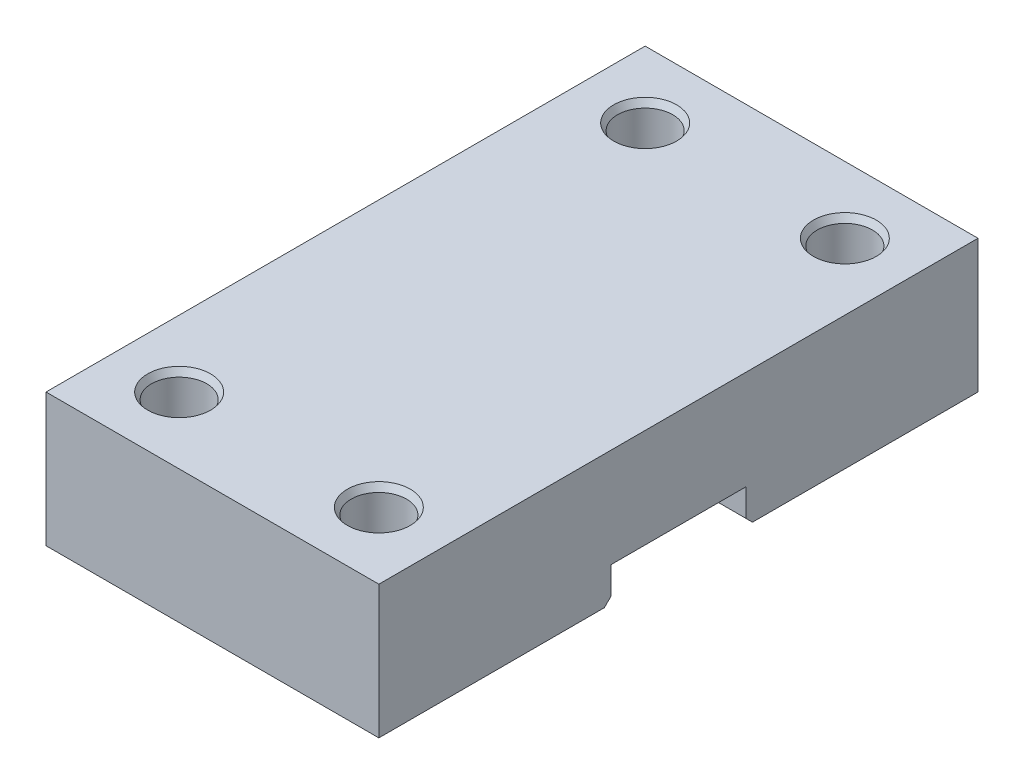
ISO-10303-21;
HEADER;
FILE_DESCRIPTION(('STEP AP214'),'2;1');
FILE_NAME('part.step','',(''),(''),'','','');
FILE_SCHEMA(('AUTOMOTIVE_DESIGN { 1 0 10303 214 1 1 1 1 }'));
ENDSEC;
DATA;
#1=APPLICATION_CONTEXT('core data for automotive mechanical design processes');
#2=APPLICATION_PROTOCOL_DEFINITION('international standard','automotive_design',2000,#1);
#3=PRODUCT_CONTEXT('',#1,'mechanical');
#4=PRODUCT('Part','Part','',(#3));
#5=PRODUCT_RELATED_PRODUCT_CATEGORY('part','',(#4));
#6=PRODUCT_DEFINITION_FORMATION('','',#4);
#7=PRODUCT_DEFINITION_CONTEXT('part definition',#1,'design');
#8=PRODUCT_DEFINITION('design','',#6,#7);
#9=PRODUCT_DEFINITION_SHAPE('','',#8);
#10=(LENGTH_UNIT() NAMED_UNIT(*) SI_UNIT(.MILLI.,.METRE.));
#11=(NAMED_UNIT(*) PLANE_ANGLE_UNIT() SI_UNIT($,.RADIAN.));
#12=(NAMED_UNIT(*) SI_UNIT($,.STERADIAN.) SOLID_ANGLE_UNIT());
#13=UNCERTAINTY_MEASURE_WITH_UNIT(LENGTH_MEASURE(1.E-05),#10,'distance_accuracy_value','');
#14=(GEOMETRIC_REPRESENTATION_CONTEXT(3) GLOBAL_UNCERTAINTY_ASSIGNED_CONTEXT((#13)) GLOBAL_UNIT_ASSIGNED_CONTEXT((#10,
#11,#12)) REPRESENTATION_CONTEXT('',''));
#15=CARTESIAN_POINT('',(0.,0.,0.));
#16=DIRECTION('',(0.,0.,1.));
#17=DIRECTION('',(1.,0.,0.));
#18=AXIS2_PLACEMENT_3D('',#15,#16,#17);
#19=CARTESIAN_POINT('',(0.,0.,0.));
#20=DIRECTION('',(0.,1.,0.));
#21=DIRECTION('',(0.,0.,1.));
#22=AXIS2_PLACEMENT_3D('',#19,#20,#21);
#23=PLANE('',#22);
#24=CARTESIAN_POINT('',(15.,0.,35.));
#25=DIRECTION('',(0.,-1.,0.));
#26=DIRECTION('',(0.,0.,-1.));
#27=AXIS2_PLACEMENT_3D('',#24,#25,#26);
#28=CIRCLE('',#27,4.15);
#29=CARTESIAN_POINT('',(15.,0.,30.85));
#30=VERTEX_POINT('',#29);
#31=EDGE_CURVE('E242',#30,#30,#28,.T.);
#32=ORIENTED_EDGE('',*,*,#31,.F.);
#33=EDGE_LOOP('',(#32));
#34=FACE_BOUND('',#33,.T.);
#35=CARTESIAN_POINT('',(-15.,0.,35.));
#36=DIRECTION('',(0.,-1.,0.));
#37=DIRECTION('',(0.,0.,-1.));
#38=AXIS2_PLACEMENT_3D('',#35,#36,#37);
#39=CIRCLE('',#38,4.15);
#40=CARTESIAN_POINT('',(-15.,0.,30.85));
#41=VERTEX_POINT('',#40);
#42=EDGE_CURVE('E240',#41,#41,#39,.T.);
#43=ORIENTED_EDGE('',*,*,#42,.F.);
#44=EDGE_LOOP('',(#43));
#45=FACE_BOUND('',#44,.T.);
#46=DIRECTION('',(0.,0.,1.));
#47=VECTOR('',#46,1.);
#48=CARTESIAN_POINT('',(-25.,0.,45.));
#49=LINE('',#48,#47);
#50=CARTESIAN_POINT('',(-25.,0.,11.125));
#51=VERTEX_POINT('',#50);
#52=CARTESIAN_POINT('',(-25.,0.,45.));
#53=VERTEX_POINT('',#52);
#54=EDGE_CURVE('E143',#51,#53,#49,.T.);
#55=ORIENTED_EDGE('',*,*,#54,.F.);
#56=DIRECTION('',(1.,0.,0.));
#57=VECTOR('',#56,1.);
#58=CARTESIAN_POINT('',(0.,0.,11.125));
#59=LINE('',#58,#57);
#60=CARTESIAN_POINT('',(25.,0.,11.125));
#61=VERTEX_POINT('',#60);
#62=EDGE_CURVE('E43',#51,#61,#59,.T.);
#63=ORIENTED_EDGE('',*,*,#62,.T.);
#64=DIRECTION('',(0.,0.,-1.));
#65=VECTOR('',#64,1.);
#66=CARTESIAN_POINT('',(25.,0.,45.));
#67=LINE('',#66,#65);
#68=CARTESIAN_POINT('',(25.,0.,45.));
#69=VERTEX_POINT('',#68);
#70=EDGE_CURVE('E160',#69,#61,#67,.T.);
#71=ORIENTED_EDGE('',*,*,#70,.F.);
#72=DIRECTION('',(1.,0.,0.));
#73=VECTOR('',#72,1.);
#74=CARTESIAN_POINT('',(25.,0.,45.));
#75=LINE('',#74,#73);
#76=EDGE_CURVE('E157',#53,#69,#75,.T.);
#77=ORIENTED_EDGE('',*,*,#76,.F.);
#78=EDGE_LOOP('',(#55,#63,#71,#77));
#79=FACE_BOUND('',#78,.T.);
#80=ADVANCED_FACE('F35',(#34,#45,#79),#23,.F.);
#81=CARTESIAN_POINT('',(-25.,20.,45.));
#82=DIRECTION('',(1.,0.,0.));
#83=DIRECTION('',(0.,0.,-1.));
#84=AXIS2_PLACEMENT_3D('',#81,#82,#83);
#85=PLANE('',#84);
#86=CARTESIAN_POINT('',(-25.,0.,-45.));
#87=VERTEX_POINT('',#86);
#88=CARTESIAN_POINT('',(-25.,0.,-11.125));
#89=VERTEX_POINT('',#88);
#90=EDGE_CURVE('E155',#87,#89,#49,.T.);
#91=ORIENTED_EDGE('',*,*,#90,.T.);
#92=DIRECTION('',(0.,-0.707106781186552,-0.707106781186543));
#93=VECTOR('',#92,1.);
#94=CARTESIAN_POINT('',(-25.,1.00000000000003,-10.125));
#95=LINE('',#94,#93);
#96=CARTESIAN_POINT('',(-25.,1.00000000000003,-10.125));
#97=VERTEX_POINT('',#96);
#98=EDGE_CURVE('E118',#89,#97,#95,.F.);
#99=ORIENTED_EDGE('',*,*,#98,.T.);
#100=DIRECTION('',(0.,1.,0.));
#101=VECTOR('',#100,1.);
#102=CARTESIAN_POINT('',(-25.,5.10000000000001,-10.125));
#103=LINE('',#102,#101);
#104=CARTESIAN_POINT('',(-25.,5.10000000000001,-10.125));
#105=VERTEX_POINT('',#104);
#106=EDGE_CURVE('E111',#97,#105,#103,.T.);
#107=ORIENTED_EDGE('',*,*,#106,.T.);
#108=DIRECTION('',(0.,0.,1.));
#109=VECTOR('',#108,1.);
#110=CARTESIAN_POINT('',(-25.,5.10000000000001,-10.125));
#111=LINE('',#110,#109);
#112=CARTESIAN_POINT('',(-25.,5.1,10.125));
#113=VERTEX_POINT('',#112);
#114=EDGE_CURVE('E116',#105,#113,#111,.T.);
#115=ORIENTED_EDGE('',*,*,#114,.T.);
#116=DIRECTION('',(0.,-1.,0.));
#117=VECTOR('',#116,1.);
#118=CARTESIAN_POINT('',(-25.,5.1,10.125));
#119=LINE('',#118,#117);
#120=CARTESIAN_POINT('',(-25.,1.00000000000001,10.125));
#121=VERTEX_POINT('',#120);
#122=EDGE_CURVE('E122',#113,#121,#119,.T.);
#123=ORIENTED_EDGE('',*,*,#122,.T.);
#124=DIRECTION('',(0.,0.707106781186548,-0.707106781186548));
#125=VECTOR('',#124,1.);
#126=CARTESIAN_POINT('',(-25.,0.,11.125));
#127=LINE('',#126,#125);
#128=EDGE_CURVE('E50',#121,#51,#127,.F.);
#129=ORIENTED_EDGE('',*,*,#128,.T.);
#130=ORIENTED_EDGE('',*,*,#54,.T.);
#131=DIRECTION('',(0.,-1.,0.));
#132=VECTOR('',#131,1.);
#133=CARTESIAN_POINT('',(-25.,20.,45.));
#134=LINE('',#133,#132);
#135=CARTESIAN_POINT('',(-25.,20.,45.));
#136=VERTEX_POINT('',#135);
#137=EDGE_CURVE('E172',#136,#53,#134,.T.);
#138=ORIENTED_EDGE('',*,*,#137,.F.);
#139=DIRECTION('',(0.,0.,1.));
#140=VECTOR('',#139,1.);
#141=CARTESIAN_POINT('',(-25.,20.,45.));
#142=LINE('',#141,#140);
#143=CARTESIAN_POINT('',(-25.,20.,-45.));
#144=VERTEX_POINT('',#143);
#145=EDGE_CURVE('E144',#144,#136,#142,.T.);
#146=ORIENTED_EDGE('',*,*,#145,.F.);
#147=DIRECTION('',(0.,-1.,0.));
#148=VECTOR('',#147,1.);
#149=CARTESIAN_POINT('',(-25.,20.,-45.));
#150=LINE('',#149,#148);
#151=EDGE_CURVE('E154',#144,#87,#150,.T.);
#152=ORIENTED_EDGE('',*,*,#151,.T.);
#153=EDGE_LOOP('',(#91,#99,#107,#115,#123,#129,#130,#138,#146,#152));
#154=FACE_BOUND('',#153,.T.);
#155=ADVANCED_FACE('F114',(#154),#85,.F.);
#156=CARTESIAN_POINT('',(25.,20.,45.));
#157=DIRECTION('',(0.,0.,-1.));
#158=DIRECTION('',(-1.,0.,0.));
#159=AXIS2_PLACEMENT_3D('',#156,#157,#158);
#160=PLANE('',#159);
#161=ORIENTED_EDGE('',*,*,#76,.T.);
#162=DIRECTION('',(0.,-1.,0.));
#163=VECTOR('',#162,1.);
#164=CARTESIAN_POINT('',(25.,20.,45.));
#165=LINE('',#164,#163);
#166=CARTESIAN_POINT('',(25.,20.,45.));
#167=VERTEX_POINT('',#166);
#168=EDGE_CURVE('E169',#167,#69,#165,.T.);
#169=ORIENTED_EDGE('',*,*,#168,.F.);
#170=DIRECTION('',(1.,0.,0.));
#171=VECTOR('',#170,1.);
#172=CARTESIAN_POINT('',(25.,20.,45.));
#173=LINE('',#172,#171);
#174=EDGE_CURVE('E147',#136,#167,#173,.T.);
#175=ORIENTED_EDGE('',*,*,#174,.F.);
#176=ORIENTED_EDGE('',*,*,#137,.T.);
#177=EDGE_LOOP('',(#161,#169,#175,#176));
#178=FACE_BOUND('',#177,.T.);
#179=ADVANCED_FACE('F222',(#178),#160,.F.);
#180=CARTESIAN_POINT('',(25.,20.,45.));
#181=DIRECTION('',(-1.,0.,0.));
#182=DIRECTION('',(0.,0.,1.));
#183=AXIS2_PLACEMENT_3D('',#180,#181,#182);
#184=PLANE('',#183);
#185=DIRECTION('',(0.,-1.,0.));
#186=VECTOR('',#185,1.);
#187=CARTESIAN_POINT('',(25.,20.,-10.125));
#188=LINE('',#187,#186);
#189=CARTESIAN_POINT('',(25.,5.10000000000001,-10.125));
#190=VERTEX_POINT('',#189);
#191=CARTESIAN_POINT('',(25.,1.00000000000003,-10.125));
#192=VERTEX_POINT('',#191);
#193=EDGE_CURVE('E128',#190,#192,#188,.T.);
#194=ORIENTED_EDGE('',*,*,#193,.T.);
#195=DIRECTION('',(0.,0.707106781186552,0.707106781186543));
#196=VECTOR('',#195,1.);
#197=CARTESIAN_POINT('',(25.,1.00000000000003,-10.125));
#198=LINE('',#197,#196);
#199=CARTESIAN_POINT('',(25.,0.,-11.125));
#200=VERTEX_POINT('',#199);
#201=EDGE_CURVE('E205',#192,#200,#198,.F.);
#202=ORIENTED_EDGE('',*,*,#201,.T.);
#203=CARTESIAN_POINT('',(25.,0.,-45.));
#204=VERTEX_POINT('',#203);
#205=EDGE_CURVE('E159',#200,#204,#67,.T.);
#206=ORIENTED_EDGE('',*,*,#205,.T.);
#207=DIRECTION('',(0.,-1.,0.));
#208=VECTOR('',#207,1.);
#209=CARTESIAN_POINT('',(25.,20.,-45.));
#210=LINE('',#209,#208);
#211=CARTESIAN_POINT('',(25.,20.,-45.));
#212=VERTEX_POINT('',#211);
#213=EDGE_CURVE('E166',#212,#204,#210,.T.);
#214=ORIENTED_EDGE('',*,*,#213,.F.);
#215=DIRECTION('',(0.,0.,-1.));
#216=VECTOR('',#215,1.);
#217=CARTESIAN_POINT('',(25.,20.,45.));
#218=LINE('',#217,#216);
#219=EDGE_CURVE('E150',#167,#212,#218,.T.);
#220=ORIENTED_EDGE('',*,*,#219,.F.);
#221=ORIENTED_EDGE('',*,*,#168,.T.);
#222=ORIENTED_EDGE('',*,*,#70,.T.);
#223=DIRECTION('',(0.,-0.707106781186548,0.707106781186548));
#224=VECTOR('',#223,1.);
#225=CARTESIAN_POINT('',(25.,0.,11.125));
#226=LINE('',#225,#224);
#227=CARTESIAN_POINT('',(25.,1.00000000000001,10.125));
#228=VERTEX_POINT('',#227);
#229=EDGE_CURVE('E203',#61,#228,#226,.F.);
#230=ORIENTED_EDGE('',*,*,#229,.T.);
#231=DIRECTION('',(0.,1.,0.));
#232=VECTOR('',#231,1.);
#233=CARTESIAN_POINT('',(25.,20.,10.125));
#234=LINE('',#233,#232);
#235=CARTESIAN_POINT('',(25.,5.1,10.125));
#236=VERTEX_POINT('',#235);
#237=EDGE_CURVE('E141',#228,#236,#234,.T.);
#238=ORIENTED_EDGE('',*,*,#237,.T.);
#239=DIRECTION('',(0.,0.,-1.));
#240=VECTOR('',#239,1.);
#241=CARTESIAN_POINT('',(25.,5.1,45.));
#242=LINE('',#241,#240);
#243=EDGE_CURVE('E175',#236,#190,#242,.T.);
#244=ORIENTED_EDGE('',*,*,#243,.T.);
#245=EDGE_LOOP('',(#194,#202,#206,#214,#220,#221,#222,#230,#238,#244));
#246=FACE_BOUND('',#245,.T.);
#247=ADVANCED_FACE('F217',(#246),#184,.F.);
#248=CARTESIAN_POINT('',(25.,20.,-45.));
#249=DIRECTION('',(0.,0.,1.));
#250=DIRECTION('',(1.,0.,0.));
#251=AXIS2_PLACEMENT_3D('',#248,#249,#250);
#252=PLANE('',#251);
#253=DIRECTION('',(-1.,0.,0.));
#254=VECTOR('',#253,1.);
#255=CARTESIAN_POINT('',(25.,0.,-45.));
#256=LINE('',#255,#254);
#257=EDGE_CURVE('E148',#204,#87,#256,.T.);
#258=ORIENTED_EDGE('',*,*,#257,.T.);
#259=ORIENTED_EDGE('',*,*,#151,.F.);
#260=DIRECTION('',(-1.,0.,0.));
#261=VECTOR('',#260,1.);
#262=CARTESIAN_POINT('',(25.,20.,-45.));
#263=LINE('',#262,#261);
#264=EDGE_CURVE('E152',#212,#144,#263,.T.);
#265=ORIENTED_EDGE('',*,*,#264,.F.);
#266=ORIENTED_EDGE('',*,*,#213,.T.);
#267=EDGE_LOOP('',(#258,#259,#265,#266));
#268=FACE_BOUND('',#267,.T.);
#269=ADVANCED_FACE('F231',(#268),#252,.F.);
#270=CARTESIAN_POINT('',(0.,20.,0.));
#271=DIRECTION('',(0.,1.,0.));
#272=DIRECTION('',(0.,0.,1.));
#273=AXIS2_PLACEMENT_3D('',#270,#271,#272);
#274=PLANE('',#273);
#275=CARTESIAN_POINT('',(15.,20.,-35.));
#276=DIRECTION('',(0.,1.,0.));
#277=DIRECTION('',(0.,0.,1.));
#278=AXIS2_PLACEMENT_3D('',#275,#276,#277);
#279=CIRCLE('',#278,4.72735026918963);
#280=CARTESIAN_POINT('',(15.,20.,-30.2726497308104));
#281=VERTEX_POINT('',#280);
#282=EDGE_CURVE('E186',#281,#281,#279,.F.);
#283=ORIENTED_EDGE('',*,*,#282,.T.);
#284=EDGE_LOOP('',(#283));
#285=FACE_BOUND('',#284,.T.);
#286=CARTESIAN_POINT('',(15.,20.,35.));
#287=DIRECTION('',(0.,1.,0.));
#288=DIRECTION('',(0.,0.,1.));
#289=AXIS2_PLACEMENT_3D('',#286,#287,#288);
#290=CIRCLE('',#289,4.72735026918963);
#291=CARTESIAN_POINT('',(15.,20.,39.7273502691896));
#292=VERTEX_POINT('',#291);
#293=EDGE_CURVE('E183',#292,#292,#290,.F.);
#294=ORIENTED_EDGE('',*,*,#293,.T.);
#295=EDGE_LOOP('',(#294));
#296=FACE_BOUND('',#295,.T.);
#297=CARTESIAN_POINT('',(-15.,20.,35.));
#298=DIRECTION('',(0.,1.,0.));
#299=DIRECTION('',(0.,0.,1.));
#300=AXIS2_PLACEMENT_3D('',#297,#298,#299);
#301=CIRCLE('',#300,4.72735026918963);
#302=CARTESIAN_POINT('',(-15.,20.,39.7273502691896));
#303=VERTEX_POINT('',#302);
#304=EDGE_CURVE('E180',#303,#303,#301,.F.);
#305=ORIENTED_EDGE('',*,*,#304,.T.);
#306=EDGE_LOOP('',(#305));
#307=FACE_BOUND('',#306,.T.);
#308=CARTESIAN_POINT('',(-15.,20.,-35.));
#309=DIRECTION('',(0.,1.,0.));
#310=DIRECTION('',(0.,0.,1.));
#311=AXIS2_PLACEMENT_3D('',#308,#309,#310);
#312=CIRCLE('',#311,4.72735026918963);
#313=CARTESIAN_POINT('',(-15.,20.,-30.2726497308104));
#314=VERTEX_POINT('',#313);
#315=EDGE_CURVE('E177',#314,#314,#312,.F.);
#316=ORIENTED_EDGE('',*,*,#315,.T.);
#317=EDGE_LOOP('',(#316));
#318=FACE_BOUND('',#317,.T.);
#319=ORIENTED_EDGE('',*,*,#145,.T.);
#320=ORIENTED_EDGE('',*,*,#174,.T.);
#321=ORIENTED_EDGE('',*,*,#219,.T.);
#322=ORIENTED_EDGE('',*,*,#264,.T.);
#323=EDGE_LOOP('',(#319,#320,#321,#322));
#324=FACE_BOUND('',#323,.T.);
#325=ADVANCED_FACE('F228',(#285,#296,#307,#318,#324),#274,.T.);
#326=CARTESIAN_POINT('',(15.,0.,-35.));
#327=DIRECTION('',(0.,-1.,0.));
#328=DIRECTION('',(0.,0.,-1.));
#329=AXIS2_PLACEMENT_3D('',#326,#327,#328);
#330=CIRCLE('',#329,4.15);
#331=CARTESIAN_POINT('',(15.,0.,-39.15));
#332=VERTEX_POINT('',#331);
#333=EDGE_CURVE('E248',#332,#332,#330,.T.);
#334=ORIENTED_EDGE('',*,*,#333,.F.);
#335=EDGE_LOOP('',(#334));
#336=FACE_BOUND('',#335,.T.);
#337=CARTESIAN_POINT('',(-15.,0.,-35.));
#338=DIRECTION('',(0.,-1.,0.));
#339=DIRECTION('',(0.,0.,-1.));
#340=AXIS2_PLACEMENT_3D('',#337,#338,#339);
#341=CIRCLE('',#340,4.15);
#342=CARTESIAN_POINT('',(-15.,0.,-39.15));
#343=VERTEX_POINT('',#342);
#344=EDGE_CURVE('E245',#343,#343,#341,.T.);
#345=ORIENTED_EDGE('',*,*,#344,.F.);
#346=EDGE_LOOP('',(#345));
#347=FACE_BOUND('',#346,.T.);
#348=ORIENTED_EDGE('',*,*,#205,.F.);
#349=DIRECTION('',(-1.,0.,0.));
#350=VECTOR('',#349,1.);
#351=CARTESIAN_POINT('',(0.,0.,-11.125));
#352=LINE('',#351,#350);
#353=EDGE_CURVE('E207',#200,#89,#352,.T.);
#354=ORIENTED_EDGE('',*,*,#353,.T.);
#355=ORIENTED_EDGE('',*,*,#90,.F.);
#356=ORIENTED_EDGE('',*,*,#257,.F.);
#357=EDGE_LOOP('',(#348,#354,#355,#356));
#358=FACE_BOUND('',#357,.T.);
#359=ADVANCED_FACE('F235',(#336,#347,#358),#23,.F.);
#360=CARTESIAN_POINT('',(-25.,5.10000000000001,-10.125));
#361=DIRECTION('',(0.,1.,0.));
#362=DIRECTION('',(0.,0.,1.));
#363=AXIS2_PLACEMENT_3D('',#360,#361,#362);
#364=PLANE('',#363);
#365=DIRECTION('',(1.,0.,0.));
#366=VECTOR('',#365,1.);
#367=CARTESIAN_POINT('',(-25.,5.1,10.125));
#368=LINE('',#367,#366);
#369=EDGE_CURVE('E132',#113,#236,#368,.T.);
#370=ORIENTED_EDGE('',*,*,#369,.F.);
#371=ORIENTED_EDGE('',*,*,#114,.F.);
#372=DIRECTION('',(1.,0.,0.));
#373=VECTOR('',#372,1.);
#374=CARTESIAN_POINT('',(-25.,5.10000000000001,-10.125));
#375=LINE('',#374,#373);
#376=EDGE_CURVE('E125',#105,#190,#375,.T.);
#377=ORIENTED_EDGE('',*,*,#376,.T.);
#378=ORIENTED_EDGE('',*,*,#243,.F.);
#379=EDGE_LOOP('',(#370,#371,#377,#378));
#380=FACE_BOUND('',#379,.T.);
#381=ADVANCED_FACE('F134',(#380),#364,.F.);
#382=CARTESIAN_POINT('',(-25.,5.1,10.125));
#383=DIRECTION('',(0.,0.,1.));
#384=DIRECTION('',(1.,0.,0.));
#385=AXIS2_PLACEMENT_3D('',#382,#383,#384);
#386=PLANE('',#385);
#387=ORIENTED_EDGE('',*,*,#237,.F.);
#388=DIRECTION('',(-1.,0.,0.));
#389=VECTOR('',#388,1.);
#390=CARTESIAN_POINT('',(-25.,1.00000000000001,10.125));
#391=LINE('',#390,#389);
#392=EDGE_CURVE('E11',#228,#121,#391,.T.);
#393=ORIENTED_EDGE('',*,*,#392,.T.);
#394=ORIENTED_EDGE('',*,*,#122,.F.);
#395=ORIENTED_EDGE('',*,*,#369,.T.);
#396=EDGE_LOOP('',(#387,#393,#394,#395));
#397=FACE_BOUND('',#396,.T.);
#398=ADVANCED_FACE('F239',(#397),#386,.F.);
#399=CARTESIAN_POINT('',(-25.,5.10000000000001,-10.125));
#400=DIRECTION('',(0.,0.,-1.));
#401=DIRECTION('',(0.,1.,0.));
#402=AXIS2_PLACEMENT_3D('',#399,#400,#401);
#403=PLANE('',#402);
#404=ORIENTED_EDGE('',*,*,#106,.F.);
#405=DIRECTION('',(1.,0.,0.));
#406=VECTOR('',#405,1.);
#407=CARTESIAN_POINT('',(-25.,1.00000000000003,-10.125));
#408=LINE('',#407,#406);
#409=EDGE_CURVE('E201',#97,#192,#408,.T.);
#410=ORIENTED_EDGE('',*,*,#409,.T.);
#411=ORIENTED_EDGE('',*,*,#193,.F.);
#412=ORIENTED_EDGE('',*,*,#376,.F.);
#413=EDGE_LOOP('',(#404,#410,#411,#412));
#414=FACE_BOUND('',#413,.T.);
#415=ADVANCED_FACE('F126',(#414),#403,.F.);
#416=CARTESIAN_POINT('',(-15.,20.,35.));
#417=DIRECTION('',(0.,-1.,0.));
#418=DIRECTION('',(0.,0.,-1.));
#419=AXIS2_PLACEMENT_3D('',#416,#417,#418);
#420=CYLINDRICAL_SURFACE('',#419,4.15);
#421=CARTESIAN_POINT('',(-15.,19.,35.));
#422=DIRECTION('',(0.,1.,0.));
#423=DIRECTION('',(0.,0.,1.));
#424=AXIS2_PLACEMENT_3D('',#421,#422,#423);
#425=CIRCLE('',#424,4.15);
#426=CARTESIAN_POINT('',(-15.,19.,39.15));
#427=VERTEX_POINT('',#426);
#428=EDGE_CURVE('E195',#427,#427,#425,.T.);
#429=ORIENTED_EDGE('',*,*,#428,.T.);
#430=EDGE_LOOP('',(#429));
#431=FACE_BOUND('',#430,.T.);
#432=ORIENTED_EDGE('',*,*,#42,.T.);
#433=EDGE_LOOP('',(#432));
#434=FACE_BOUND('',#433,.T.);
#435=ADVANCED_FACE('F261',(#431,#434),#420,.F.);
#436=CARTESIAN_POINT('',(-15.,20.,-35.));
#437=DIRECTION('',(0.,-1.,0.));
#438=DIRECTION('',(0.,0.,-1.));
#439=AXIS2_PLACEMENT_3D('',#436,#437,#438);
#440=CYLINDRICAL_SURFACE('',#439,4.15);
#441=CARTESIAN_POINT('',(-15.,19.,-35.));
#442=DIRECTION('',(0.,1.,0.));
#443=DIRECTION('',(0.,0.,1.));
#444=AXIS2_PLACEMENT_3D('',#441,#442,#443);
#445=CIRCLE('',#444,4.15);
#446=CARTESIAN_POINT('',(-15.,19.,-30.85));
#447=VERTEX_POINT('',#446);
#448=EDGE_CURVE('E198',#447,#447,#445,.T.);
#449=ORIENTED_EDGE('',*,*,#448,.T.);
#450=EDGE_LOOP('',(#449));
#451=FACE_BOUND('',#450,.T.);
#452=ORIENTED_EDGE('',*,*,#344,.T.);
#453=EDGE_LOOP('',(#452));
#454=FACE_BOUND('',#453,.T.);
#455=ADVANCED_FACE('F263',(#451,#454),#440,.F.);
#456=CARTESIAN_POINT('',(15.,20.,-35.));
#457=DIRECTION('',(0.,-1.,0.));
#458=DIRECTION('',(0.,0.,-1.));
#459=AXIS2_PLACEMENT_3D('',#456,#457,#458);
#460=CYLINDRICAL_SURFACE('',#459,4.15);
#461=CARTESIAN_POINT('',(15.,19.,-35.));
#462=DIRECTION('',(0.,1.,0.));
#463=DIRECTION('',(0.,0.,1.));
#464=AXIS2_PLACEMENT_3D('',#461,#462,#463);
#465=CIRCLE('',#464,4.15);
#466=CARTESIAN_POINT('',(15.,19.,-30.85));
#467=VERTEX_POINT('',#466);
#468=EDGE_CURVE('E189',#467,#467,#465,.T.);
#469=ORIENTED_EDGE('',*,*,#468,.T.);
#470=EDGE_LOOP('',(#469));
#471=FACE_BOUND('',#470,.T.);
#472=ORIENTED_EDGE('',*,*,#333,.T.);
#473=EDGE_LOOP('',(#472));
#474=FACE_BOUND('',#473,.T.);
#475=ADVANCED_FACE('F270',(#471,#474),#460,.F.);
#476=CARTESIAN_POINT('',(15.,20.,35.));
#477=DIRECTION('',(0.,-1.,0.));
#478=DIRECTION('',(0.,0.,-1.));
#479=AXIS2_PLACEMENT_3D('',#476,#477,#478);
#480=CYLINDRICAL_SURFACE('',#479,4.15);
#481=CARTESIAN_POINT('',(15.,19.,35.));
#482=DIRECTION('',(0.,1.,0.));
#483=DIRECTION('',(0.,0.,1.));
#484=AXIS2_PLACEMENT_3D('',#481,#482,#483);
#485=CIRCLE('',#484,4.15);
#486=CARTESIAN_POINT('',(15.,19.,39.15));
#487=VERTEX_POINT('',#486);
#488=EDGE_CURVE('E192',#487,#487,#485,.T.);
#489=ORIENTED_EDGE('',*,*,#488,.T.);
#490=EDGE_LOOP('',(#489));
#491=FACE_BOUND('',#490,.T.);
#492=ORIENTED_EDGE('',*,*,#31,.T.);
#493=EDGE_LOOP('',(#492));
#494=FACE_BOUND('',#493,.T.);
#495=ADVANCED_FACE('F254',(#491,#494),#480,.F.);
#496=CARTESIAN_POINT('',(15.,20.,-35.));
#497=DIRECTION('',(0.,1.,0.));
#498=DIRECTION('',(0.,0.,1.));
#499=AXIS2_PLACEMENT_3D('',#496,#497,#498);
#500=CONICAL_SURFACE('',#499,4.72735026918963,0.523598775598292);
#501=ORIENTED_EDGE('',*,*,#468,.F.);
#502=EDGE_LOOP('',(#501));
#503=FACE_BOUND('',#502,.T.);
#504=ORIENTED_EDGE('',*,*,#282,.F.);
#505=EDGE_LOOP('',(#504));
#506=FACE_BOUND('',#505,.T.);
#507=ADVANCED_FACE('F294',(#503,#506),#500,.F.);
#508=CARTESIAN_POINT('',(15.,20.,35.));
#509=DIRECTION('',(0.,1.,0.));
#510=DIRECTION('',(0.,0.,1.));
#511=AXIS2_PLACEMENT_3D('',#508,#509,#510);
#512=CONICAL_SURFACE('',#511,4.72735026918963,0.523598775598292);
#513=ORIENTED_EDGE('',*,*,#488,.F.);
#514=EDGE_LOOP('',(#513));
#515=FACE_BOUND('',#514,.T.);
#516=ORIENTED_EDGE('',*,*,#293,.F.);
#517=EDGE_LOOP('',(#516));
#518=FACE_BOUND('',#517,.T.);
#519=ADVANCED_FACE('F297',(#515,#518),#512,.F.);
#520=CARTESIAN_POINT('',(-15.,20.,35.));
#521=DIRECTION('',(0.,1.,0.));
#522=DIRECTION('',(0.,0.,1.));
#523=AXIS2_PLACEMENT_3D('',#520,#521,#522);
#524=CONICAL_SURFACE('',#523,4.72735026918963,0.523598775598292);
#525=ORIENTED_EDGE('',*,*,#428,.F.);
#526=EDGE_LOOP('',(#525));
#527=FACE_BOUND('',#526,.T.);
#528=ORIENTED_EDGE('',*,*,#304,.F.);
#529=EDGE_LOOP('',(#528));
#530=FACE_BOUND('',#529,.T.);
#531=ADVANCED_FACE('F301',(#527,#530),#524,.F.);
#532=CARTESIAN_POINT('',(-15.,20.,-35.));
#533=DIRECTION('',(0.,1.,0.));
#534=DIRECTION('',(0.,0.,1.));
#535=AXIS2_PLACEMENT_3D('',#532,#533,#534);
#536=CONICAL_SURFACE('',#535,4.72735026918963,0.523598775598292);
#537=ORIENTED_EDGE('',*,*,#448,.F.);
#538=EDGE_LOOP('',(#537));
#539=FACE_BOUND('',#538,.T.);
#540=ORIENTED_EDGE('',*,*,#315,.F.);
#541=EDGE_LOOP('',(#540));
#542=FACE_BOUND('',#541,.T.);
#543=ADVANCED_FACE('F305',(#539,#542),#536,.F.);
#544=CARTESIAN_POINT('',(-25.,1.00000000000003,-10.125));
#545=DIRECTION('',(0.,0.707106781186543,-0.707106781186552));
#546=DIRECTION('',(1.,0.,0.));
#547=AXIS2_PLACEMENT_3D('',#544,#545,#546);
#548=PLANE('',#547);
#549=ORIENTED_EDGE('',*,*,#98,.F.);
#550=ORIENTED_EDGE('',*,*,#353,.F.);
#551=ORIENTED_EDGE('',*,*,#201,.F.);
#552=ORIENTED_EDGE('',*,*,#409,.F.);
#553=EDGE_LOOP('',(#549,#550,#551,#552));
#554=FACE_BOUND('',#553,.T.);
#555=ADVANCED_FACE('F238',(#554),#548,.F.);
#556=CARTESIAN_POINT('',(0.,0.,11.125));
#557=DIRECTION('',(0.,0.707106781186547,0.707106781186547));
#558=DIRECTION('',(1.,0.,0.));
#559=AXIS2_PLACEMENT_3D('',#556,#557,#558);
#560=PLANE('',#559);
#561=ORIENTED_EDGE('',*,*,#128,.F.);
#562=ORIENTED_EDGE('',*,*,#392,.F.);
#563=ORIENTED_EDGE('',*,*,#229,.F.);
#564=ORIENTED_EDGE('',*,*,#62,.F.);
#565=EDGE_LOOP('',(#561,#562,#563,#564));
#566=FACE_BOUND('',#565,.T.);
#567=ADVANCED_FACE('F37',(#566),#560,.F.);
#568=CLOSED_SHELL('',(#80,#155,#179,#247,#269,#325,#359,#381,#398,#415,#435,#455,#475,#495,#507,
#519,#531,#543,#555,#567));
#569=MANIFOLD_SOLID_BREP('B2',#568);
#570=ADVANCED_BREP_SHAPE_REPRESENTATION('',(#18,#569),#14);
#571=SHAPE_DEFINITION_REPRESENTATION(#9,#570);
ENDSEC;
END-ISO-10303-21;
